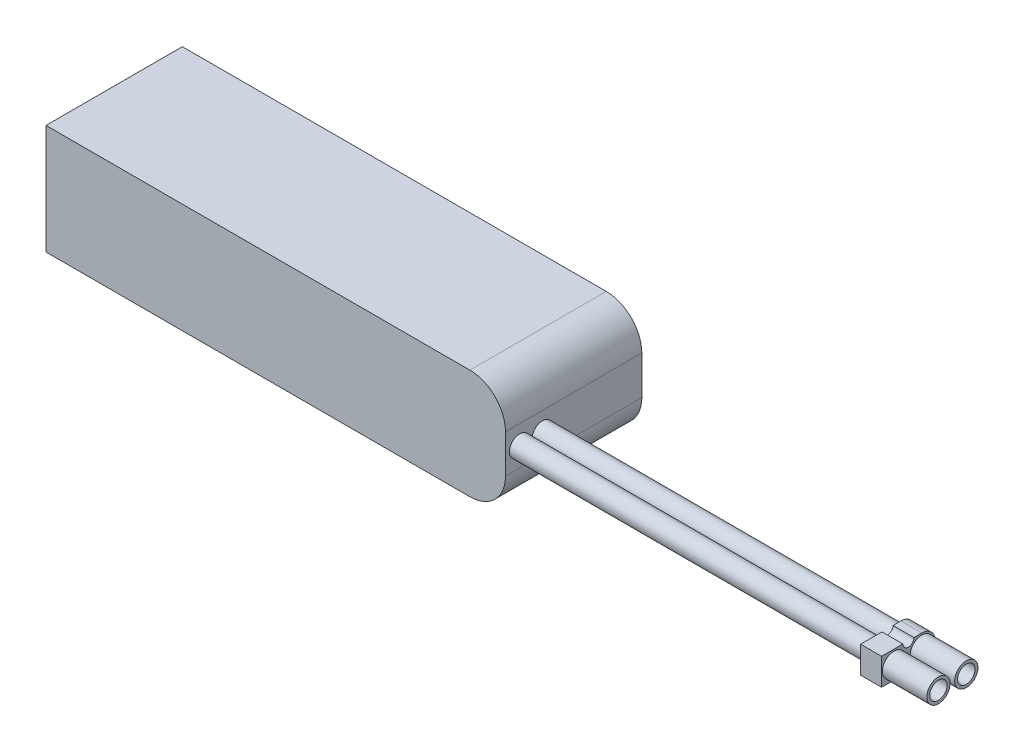
ISO-10303-21;
HEADER;
FILE_DESCRIPTION(('STEP AP214'),'2;1');
FILE_NAME('part.step','',(''),(''),'','','');
FILE_SCHEMA(('AUTOMOTIVE_DESIGN { 1 0 10303 214 1 1 1 1 }'));
ENDSEC;
DATA;
#1=APPLICATION_CONTEXT('core data for automotive mechanical design processes');
#2=APPLICATION_PROTOCOL_DEFINITION('international standard','automotive_design',2000,#1);
#3=PRODUCT_CONTEXT('',#1,'mechanical');
#4=PRODUCT('Part','Part','',(#3));
#5=PRODUCT_RELATED_PRODUCT_CATEGORY('part','',(#4));
#6=PRODUCT_DEFINITION_FORMATION('','',#4);
#7=PRODUCT_DEFINITION_CONTEXT('part definition',#1,'design');
#8=PRODUCT_DEFINITION('design','',#6,#7);
#9=PRODUCT_DEFINITION_SHAPE('','',#8);
#10=(LENGTH_UNIT() NAMED_UNIT(*) SI_UNIT(.MILLI.,.METRE.));
#11=(NAMED_UNIT(*) PLANE_ANGLE_UNIT() SI_UNIT($,.RADIAN.));
#12=(NAMED_UNIT(*) SI_UNIT($,.STERADIAN.) SOLID_ANGLE_UNIT());
#13=UNCERTAINTY_MEASURE_WITH_UNIT(LENGTH_MEASURE(1.E-05),#10,'distance_accuracy_value','');
#14=(GEOMETRIC_REPRESENTATION_CONTEXT(3) GLOBAL_UNCERTAINTY_ASSIGNED_CONTEXT((#13)) GLOBAL_UNIT_ASSIGNED_CONTEXT((#10,
#11,#12)) REPRESENTATION_CONTEXT('',''));
#15=CARTESIAN_POINT('',(0.,0.,0.));
#16=DIRECTION('',(0.,0.,1.));
#17=DIRECTION('',(1.,0.,0.));
#18=AXIS2_PLACEMENT_3D('',#15,#16,#17);
#19=CARTESIAN_POINT('',(-77.5,-18.5,23.));
#20=DIRECTION('',(1.,0.,0.));
#21=DIRECTION('',(0.,0.,-1.));
#22=AXIS2_PLACEMENT_3D('',#19,#20,#21);
#23=PLANE('',#22);
#24=DIRECTION('',(0.,-1.,0.));
#25=VECTOR('',#24,1.);
#26=CARTESIAN_POINT('',(-77.5,-18.5,-23.));
#27=LINE('',#26,#25);
#28=CARTESIAN_POINT('',(-77.5,18.5,-23.));
#29=VERTEX_POINT('',#28);
#30=CARTESIAN_POINT('',(-77.5,-18.5,-23.));
#31=VERTEX_POINT('',#30);
#32=EDGE_CURVE('E163',#29,#31,#27,.T.);
#33=ORIENTED_EDGE('',*,*,#32,.T.);
#34=DIRECTION('',(0.,0.,-1.));
#35=VECTOR('',#34,1.);
#36=CARTESIAN_POINT('',(-77.5,-18.5,23.));
#37=LINE('',#36,#35);
#38=CARTESIAN_POINT('',(-77.5,-18.5,23.));
#39=VERTEX_POINT('',#38);
#40=EDGE_CURVE('E199',#39,#31,#37,.T.);
#41=ORIENTED_EDGE('',*,*,#40,.F.);
#42=DIRECTION('',(0.,-1.,0.));
#43=VECTOR('',#42,1.);
#44=CARTESIAN_POINT('',(-77.5,-18.5,23.));
#45=LINE('',#44,#43);
#46=CARTESIAN_POINT('',(-77.5,18.5,23.));
#47=VERTEX_POINT('',#46);
#48=EDGE_CURVE('E169',#47,#39,#45,.T.);
#49=ORIENTED_EDGE('',*,*,#48,.F.);
#50=DIRECTION('',(0.,0.,-1.));
#51=VECTOR('',#50,1.);
#52=CARTESIAN_POINT('',(-77.5,18.5,23.));
#53=LINE('',#52,#51);
#54=EDGE_CURVE('E183',#47,#29,#53,.T.);
#55=ORIENTED_EDGE('',*,*,#54,.T.);
#56=EDGE_LOOP('',(#33,#41,#49,#55));
#57=FACE_BOUND('',#56,.T.);
#58=ADVANCED_FACE('F39',(#57),#23,.F.);
#59=CARTESIAN_POINT('',(77.5,-18.5,23.));
#60=DIRECTION('',(0.,1.,0.));
#61=DIRECTION('',(-1.,0.,0.));
#62=AXIS2_PLACEMENT_3D('',#59,#60,#61);
#63=PLANE('',#62);
#64=DIRECTION('',(1.,0.,0.));
#65=VECTOR('',#64,1.);
#66=CARTESIAN_POINT('',(77.5,-18.5,-23.));
#67=LINE('',#66,#65);
#68=CARTESIAN_POINT('',(65.5,-18.5,-23.));
#69=VERTEX_POINT('',#68);
#70=EDGE_CURVE('E187',#31,#69,#67,.T.);
#71=ORIENTED_EDGE('',*,*,#70,.T.);
#72=DIRECTION('',(0.,0.,-1.));
#73=VECTOR('',#72,1.);
#74=CARTESIAN_POINT('',(65.5,-18.5,23.));
#75=LINE('',#74,#73);
#76=CARTESIAN_POINT('',(65.5,-18.5,23.));
#77=VERTEX_POINT('',#76);
#78=EDGE_CURVE('E63',#69,#77,#75,.F.);
#79=ORIENTED_EDGE('',*,*,#78,.T.);
#80=DIRECTION('',(1.,0.,0.));
#81=VECTOR('',#80,1.);
#82=CARTESIAN_POINT('',(77.5,-18.5,23.));
#83=LINE('',#82,#81);
#84=EDGE_CURVE('E173',#39,#77,#83,.T.);
#85=ORIENTED_EDGE('',*,*,#84,.F.);
#86=ORIENTED_EDGE('',*,*,#40,.T.);
#87=EDGE_LOOP('',(#71,#79,#85,#86));
#88=FACE_BOUND('',#87,.T.);
#89=ADVANCED_FACE('F319',(#88),#63,.F.);
#90=CARTESIAN_POINT('',(77.5,-18.5,23.));
#91=DIRECTION('',(-1.,0.,0.));
#92=DIRECTION('',(0.,0.,1.));
#93=AXIS2_PLACEMENT_3D('',#90,#91,#92);
#94=PLANE('',#93);
#95=CARTESIAN_POINT('',(77.5,0.,10.5298555470341));
#96=DIRECTION('',(-1.,0.,0.));
#97=DIRECTION('',(0.,0.,1.));
#98=AXIS2_PLACEMENT_3D('',#95,#96,#97);
#99=CIRCLE('',#98,3.47484062640741);
#100=CARTESIAN_POINT('',(77.5,0.,14.0046961734415));
#101=VERTEX_POINT('',#100);
#102=EDGE_CURVE('E234',#101,#101,#99,.F.);
#103=ORIENTED_EDGE('',*,*,#102,.F.);
#104=EDGE_LOOP('',(#103));
#105=FACE_BOUND('',#104,.T.);
#106=CARTESIAN_POINT('',(77.5,0.,18.2062696905234));
#107=DIRECTION('',(-1.,0.,0.));
#108=DIRECTION('',(0.,0.,1.));
#109=AXIS2_PLACEMENT_3D('',#106,#107,#108);
#110=CIRCLE('',#109,3.4846725245643);
#111=CARTESIAN_POINT('',(77.5,0.,21.6909422150877));
#112=VERTEX_POINT('',#111);
#113=EDGE_CURVE('E227',#112,#112,#110,.F.);
#114=ORIENTED_EDGE('',*,*,#113,.F.);
#115=EDGE_LOOP('',(#114));
#116=FACE_BOUND('',#115,.T.);
#117=DIRECTION('',(0.,1.,0.));
#118=VECTOR('',#117,1.);
#119=CARTESIAN_POINT('',(77.5,-18.5,23.));
#120=LINE('',#119,#118);
#121=CARTESIAN_POINT('',(77.5,-6.49999999999999,23.));
#122=VERTEX_POINT('',#121);
#123=CARTESIAN_POINT('',(77.5,6.50000000000001,23.));
#124=VERTEX_POINT('',#123);
#125=EDGE_CURVE('E177',#122,#124,#120,.T.);
#126=ORIENTED_EDGE('',*,*,#125,.F.);
#127=DIRECTION('',(0.,0.,-1.));
#128=VECTOR('',#127,1.);
#129=CARTESIAN_POINT('',(77.5,-6.49999999999999,23.));
#130=LINE('',#129,#128);
#131=CARTESIAN_POINT('',(77.5,-6.49999999999999,-23.));
#132=VERTEX_POINT('',#131);
#133=EDGE_CURVE('E206',#122,#132,#130,.T.);
#134=ORIENTED_EDGE('',*,*,#133,.T.);
#135=DIRECTION('',(0.,1.,0.));
#136=VECTOR('',#135,1.);
#137=CARTESIAN_POINT('',(77.5,-18.5,-23.));
#138=LINE('',#137,#136);
#139=CARTESIAN_POINT('',(77.5,6.50000000000001,-23.));
#140=VERTEX_POINT('',#139);
#141=EDGE_CURVE('E190',#132,#140,#138,.T.);
#142=ORIENTED_EDGE('',*,*,#141,.T.);
#143=DIRECTION('',(0.,0.,-1.));
#144=VECTOR('',#143,1.);
#145=CARTESIAN_POINT('',(77.5,6.50000000000001,23.));
#146=LINE('',#145,#144);
#147=EDGE_CURVE('E203',#140,#124,#146,.F.);
#148=ORIENTED_EDGE('',*,*,#147,.T.);
#149=EDGE_LOOP('',(#126,#134,#142,#148));
#150=FACE_BOUND('',#149,.T.);
#151=ADVANCED_FACE('F325',(#105,#116,#150),#94,.F.);
#152=CARTESIAN_POINT('',(77.5,18.5,23.));
#153=DIRECTION('',(0.,-1.,0.));
#154=DIRECTION('',(1.,0.,0.));
#155=AXIS2_PLACEMENT_3D('',#152,#153,#154);
#156=PLANE('',#155);
#157=DIRECTION('',(-1.,0.,0.));
#158=VECTOR('',#157,1.);
#159=CARTESIAN_POINT('',(77.5,18.5,23.));
#160=LINE('',#159,#158);
#161=CARTESIAN_POINT('',(65.5,18.5,23.));
#162=VERTEX_POINT('',#161);
#163=EDGE_CURVE('E180',#162,#47,#160,.T.);
#164=ORIENTED_EDGE('',*,*,#163,.F.);
#165=DIRECTION('',(0.,0.,-1.));
#166=VECTOR('',#165,1.);
#167=CARTESIAN_POINT('',(65.5,18.5,23.));
#168=LINE('',#167,#166);
#169=CARTESIAN_POINT('',(65.5,18.5,-23.));
#170=VERTEX_POINT('',#169);
#171=EDGE_CURVE('E223',#162,#170,#168,.T.);
#172=ORIENTED_EDGE('',*,*,#171,.T.);
#173=DIRECTION('',(-1.,0.,0.));
#174=VECTOR('',#173,1.);
#175=CARTESIAN_POINT('',(77.5,18.5,-23.));
#176=LINE('',#175,#174);
#177=EDGE_CURVE('E174',#170,#29,#176,.T.);
#178=ORIENTED_EDGE('',*,*,#177,.T.);
#179=ORIENTED_EDGE('',*,*,#54,.F.);
#180=EDGE_LOOP('',(#164,#172,#178,#179));
#181=FACE_BOUND('',#180,.T.);
#182=ADVANCED_FACE('F350',(#181),#156,.F.);
#183=CARTESIAN_POINT('',(0.,0.,23.));
#184=DIRECTION('',(0.,0.,1.));
#185=DIRECTION('',(1.,0.,0.));
#186=AXIS2_PLACEMENT_3D('',#183,#184,#185);
#187=PLANE('',#186);
#188=ORIENTED_EDGE('',*,*,#84,.T.);
#189=CARTESIAN_POINT('',(65.5,-6.49999999999999,23.));
#190=DIRECTION('',(0.,0.,1.));
#191=DIRECTION('',(1.,0.,0.));
#192=AXIS2_PLACEMENT_3D('',#189,#190,#191);
#193=CIRCLE('',#192,12.);
#194=EDGE_CURVE('E220',#77,#122,#193,.T.);
#195=ORIENTED_EDGE('',*,*,#194,.T.);
#196=ORIENTED_EDGE('',*,*,#125,.T.);
#197=CARTESIAN_POINT('',(65.5,6.50000000000001,23.));
#198=DIRECTION('',(0.,0.,1.));
#199=DIRECTION('',(1.,0.,0.));
#200=AXIS2_PLACEMENT_3D('',#197,#198,#199);
#201=CIRCLE('',#200,12.);
#202=EDGE_CURVE('E55',#124,#162,#201,.T.);
#203=ORIENTED_EDGE('',*,*,#202,.T.);
#204=ORIENTED_EDGE('',*,*,#163,.T.);
#205=ORIENTED_EDGE('',*,*,#48,.T.);
#206=EDGE_LOOP('',(#188,#195,#196,#203,#204,#205));
#207=FACE_BOUND('',#206,.T.);
#208=ADVANCED_FACE('F338',(#207),#187,.T.);
#209=CARTESIAN_POINT('',(0.,0.,-23.));
#210=DIRECTION('',(0.,0.,1.));
#211=DIRECTION('',(1.,0.,0.));
#212=AXIS2_PLACEMENT_3D('',#209,#210,#211);
#213=PLANE('',#212);
#214=ORIENTED_EDGE('',*,*,#141,.F.);
#215=CARTESIAN_POINT('',(65.5,-6.49999999999999,-23.));
#216=DIRECTION('',(0.,0.,1.));
#217=DIRECTION('',(1.,0.,0.));
#218=AXIS2_PLACEMENT_3D('',#215,#216,#217);
#219=CIRCLE('',#218,12.);
#220=EDGE_CURVE('E213',#132,#69,#219,.F.);
#221=ORIENTED_EDGE('',*,*,#220,.T.);
#222=ORIENTED_EDGE('',*,*,#70,.F.);
#223=ORIENTED_EDGE('',*,*,#32,.F.);
#224=ORIENTED_EDGE('',*,*,#177,.F.);
#225=CARTESIAN_POINT('',(65.5,6.50000000000001,-23.));
#226=DIRECTION('',(0.,0.,1.));
#227=DIRECTION('',(1.,0.,0.));
#228=AXIS2_PLACEMENT_3D('',#225,#226,#227);
#229=CIRCLE('',#228,12.);
#230=EDGE_CURVE('E210',#170,#140,#229,.F.);
#231=ORIENTED_EDGE('',*,*,#230,.T.);
#232=EDGE_LOOP('',(#214,#221,#222,#223,#224,#231));
#233=FACE_BOUND('',#232,.T.);
#234=ADVANCED_FACE('F330',(#233),#213,.F.);
#235=CARTESIAN_POINT('',(65.5,-6.49999999999999,23.));
#236=DIRECTION('',(0.,0.,-1.));
#237=DIRECTION('',(-1.,0.,0.));
#238=AXIS2_PLACEMENT_3D('',#235,#236,#237);
#239=CYLINDRICAL_SURFACE('',#238,12.);
#240=ORIENTED_EDGE('',*,*,#194,.F.);
#241=ORIENTED_EDGE('',*,*,#78,.F.);
#242=ORIENTED_EDGE('',*,*,#220,.F.);
#243=ORIENTED_EDGE('',*,*,#133,.F.);
#244=EDGE_LOOP('',(#240,#241,#242,#243));
#245=FACE_BOUND('',#244,.T.);
#246=ADVANCED_FACE('F328',(#245),#239,.T.);
#247=CARTESIAN_POINT('',(65.5,6.50000000000001,23.));
#248=DIRECTION('',(0.,0.,-1.));
#249=DIRECTION('',(-1.,0.,0.));
#250=AXIS2_PLACEMENT_3D('',#247,#248,#249);
#251=CYLINDRICAL_SURFACE('',#250,12.);
#252=ORIENTED_EDGE('',*,*,#202,.F.);
#253=ORIENTED_EDGE('',*,*,#147,.F.);
#254=ORIENTED_EDGE('',*,*,#230,.F.);
#255=ORIENTED_EDGE('',*,*,#171,.F.);
#256=EDGE_LOOP('',(#252,#253,#254,#255));
#257=FACE_BOUND('',#256,.T.);
#258=ADVANCED_FACE('F41',(#257),#251,.T.);
#259=CARTESIAN_POINT('',(197.5,0.,18.2062696905234));
#260=DIRECTION('',(-1.,0.,0.));
#261=DIRECTION('',(0.,0.,1.));
#262=AXIS2_PLACEMENT_3D('',#259,#260,#261);
#263=CYLINDRICAL_SURFACE('',#262,3.4846725245643);
#264=CARTESIAN_POINT('',(197.5,0.,18.2062696905234));
#265=DIRECTION('',(1.,0.,0.));
#266=DIRECTION('',(0.,0.,-1.));
#267=AXIS2_PLACEMENT_3D('',#264,#265,#266);
#268=CIRCLE('',#267,3.4846725245643);
#269=CARTESIAN_POINT('',(197.5,0.,14.7215971659591));
#270=VERTEX_POINT('',#269);
#271=EDGE_CURVE('E158',#270,#270,#268,.T.);
#272=ORIENTED_EDGE('',*,*,#271,.F.);
#273=EDGE_LOOP('',(#272));
#274=FACE_BOUND('',#273,.T.);
#275=ORIENTED_EDGE('',*,*,#113,.T.);
#276=EDGE_LOOP('',(#275));
#277=FACE_BOUND('',#276,.T.);
#278=ADVANCED_FACE('F336',(#274,#277),#263,.T.);
#279=CARTESIAN_POINT('',(204.57,-4.53,0.));
#280=DIRECTION('',(0.,1.,0.));
#281=DIRECTION('',(0.,0.,1.));
#282=AXIS2_PLACEMENT_3D('',#279,#280,#281);
#283=PLANE('',#282);
#284=DIRECTION('',(0.,0.,-1.));
#285=VECTOR('',#284,1.);
#286=CARTESIAN_POINT('',(197.5,-4.53,0.));
#287=LINE('',#286,#285);
#288=CARTESIAN_POINT('',(197.5,-4.53,23.185125141606));
#289=VERTEX_POINT('',#288);
#290=CARTESIAN_POINT('',(197.5,-4.53,9.59512514160601));
#291=VERTEX_POINT('',#290);
#292=EDGE_CURVE('E156',#289,#291,#287,.T.);
#293=ORIENTED_EDGE('',*,*,#292,.T.);
#294=DIRECTION('',(-1.,0.,0.));
#295=VECTOR('',#294,1.);
#296=CARTESIAN_POINT('',(204.57,-4.53,9.59512514160601));
#297=LINE('',#296,#295);
#298=CARTESIAN_POINT('',(204.57,-4.53,9.59512514160601));
#299=VERTEX_POINT('',#298);
#300=EDGE_CURVE('E135',#299,#291,#297,.T.);
#301=ORIENTED_EDGE('',*,*,#300,.F.);
#302=DIRECTION('',(0.,0.,-1.));
#303=VECTOR('',#302,1.);
#304=CARTESIAN_POINT('',(204.57,-4.53,0.));
#305=LINE('',#304,#303);
#306=CARTESIAN_POINT('',(204.57,-4.53,23.185125141606));
#307=VERTEX_POINT('',#306);
#308=EDGE_CURVE('E143',#307,#299,#305,.T.);
#309=ORIENTED_EDGE('',*,*,#308,.F.);
#310=DIRECTION('',(-1.,0.,0.));
#311=VECTOR('',#310,1.);
#312=CARTESIAN_POINT('',(204.57,-4.53,23.185125141606));
#313=LINE('',#312,#311);
#314=EDGE_CURVE('E259',#307,#289,#313,.T.);
#315=ORIENTED_EDGE('',*,*,#314,.T.);
#316=EDGE_LOOP('',(#293,#301,#309,#315));
#317=FACE_BOUND('',#316,.T.);
#318=ADVANCED_FACE('F154',(#317),#283,.F.);
#319=CARTESIAN_POINT('',(204.57,0.,9.59512514160601));
#320=DIRECTION('',(-1.,0.,0.));
#321=DIRECTION('',(0.,0.,1.));
#322=AXIS2_PLACEMENT_3D('',#319,#320,#321);
#323=CYLINDRICAL_SURFACE('',#322,4.53);
#324=CARTESIAN_POINT('',(197.5,0.,9.59512514160601));
#325=DIRECTION('',(1.,0.,0.));
#326=DIRECTION('',(0.,0.,-1.));
#327=AXIS2_PLACEMENT_3D('',#324,#325,#326);
#328=CIRCLE('',#327,4.53);
#329=CARTESIAN_POINT('',(197.5,4.53,9.59512514160602));
#330=VERTEX_POINT('',#329);
#331=EDGE_CURVE('E262',#291,#330,#328,.T.);
#332=ORIENTED_EDGE('',*,*,#331,.T.);
#333=DIRECTION('',(-1.,0.,0.));
#334=VECTOR('',#333,1.);
#335=CARTESIAN_POINT('',(204.57,4.53,9.59512514160602));
#336=LINE('',#335,#334);
#337=CARTESIAN_POINT('',(204.57,4.53,9.59512514160602));
#338=VERTEX_POINT('',#337);
#339=EDGE_CURVE('E138',#338,#330,#336,.T.);
#340=ORIENTED_EDGE('',*,*,#339,.F.);
#341=CARTESIAN_POINT('',(204.57,0.,9.59512514160601));
#342=DIRECTION('',(1.,0.,0.));
#343=DIRECTION('',(0.,0.,-1.));
#344=AXIS2_PLACEMENT_3D('',#341,#342,#343);
#345=CIRCLE('',#344,4.53);
#346=EDGE_CURVE('E131',#299,#338,#345,.T.);
#347=ORIENTED_EDGE('',*,*,#346,.F.);
#348=ORIENTED_EDGE('',*,*,#300,.T.);
#349=EDGE_LOOP('',(#332,#340,#347,#348));
#350=FACE_BOUND('',#349,.T.);
#351=ADVANCED_FACE('F133',(#350),#323,.T.);
#352=CARTESIAN_POINT('',(204.57,4.53,0.));
#353=DIRECTION('',(0.,-1.,0.));
#354=DIRECTION('',(0.,0.,-1.));
#355=AXIS2_PLACEMENT_3D('',#352,#353,#354);
#356=PLANE('',#355);
#357=DIRECTION('',(0.,0.,1.));
#358=VECTOR('',#357,1.);
#359=CARTESIAN_POINT('',(197.5,4.53,0.));
#360=LINE('',#359,#358);
#361=CARTESIAN_POINT('',(197.5,4.53,12.2487377040559));
#362=VERTEX_POINT('',#361);
#363=EDGE_CURVE('E265',#330,#362,#360,.T.);
#364=ORIENTED_EDGE('',*,*,#363,.T.);
#365=DIRECTION('',(-1.,0.,0.));
#366=VECTOR('',#365,1.);
#367=CARTESIAN_POINT('',(204.57,4.53,12.2487377040559));
#368=LINE('',#367,#366);
#369=CARTESIAN_POINT('',(204.57,4.53,12.2487377040559));
#370=VERTEX_POINT('',#369);
#371=EDGE_CURVE('E165',#370,#362,#368,.T.);
#372=ORIENTED_EDGE('',*,*,#371,.F.);
#373=DIRECTION('',(0.,0.,1.));
#374=VECTOR('',#373,1.);
#375=CARTESIAN_POINT('',(204.57,4.53,0.));
#376=LINE('',#375,#374);
#377=EDGE_CURVE('E142',#338,#370,#376,.T.);
#378=ORIENTED_EDGE('',*,*,#377,.F.);
#379=ORIENTED_EDGE('',*,*,#339,.T.);
#380=EDGE_LOOP('',(#364,#372,#378,#379));
#381=FACE_BOUND('',#380,.T.);
#382=ADVANCED_FACE('F295',(#381),#356,.F.);
#383=CARTESIAN_POINT('',(204.57,4.53,14.125125141606));
#384=DIRECTION('',(-1.,0.,0.));
#385=DIRECTION('',(0.,0.,1.));
#386=AXIS2_PLACEMENT_3D('',#383,#384,#385);
#387=CYLINDRICAL_SURFACE('',#386,1.87638743755012);
#388=CARTESIAN_POINT('',(197.5,4.53,14.125125141606));
#389=DIRECTION('',(1.,0.,0.));
#390=DIRECTION('',(0.,0.,-1.));
#391=AXIS2_PLACEMENT_3D('',#388,#389,#390);
#392=CIRCLE('',#391,1.87638743755012);
#393=CARTESIAN_POINT('',(197.5,4.53,16.0015125791561));
#394=VERTEX_POINT('',#393);
#395=EDGE_CURVE('E269',#394,#362,#392,.T.);
#396=ORIENTED_EDGE('',*,*,#395,.F.);
#397=DIRECTION('',(-1.,0.,0.));
#398=VECTOR('',#397,1.);
#399=CARTESIAN_POINT('',(204.57,4.53,16.0015125791561));
#400=LINE('',#399,#398);
#401=CARTESIAN_POINT('',(204.57,4.53,16.0015125791561));
#402=VERTEX_POINT('',#401);
#403=EDGE_CURVE('E285',#402,#394,#400,.T.);
#404=ORIENTED_EDGE('',*,*,#403,.F.);
#405=CARTESIAN_POINT('',(204.57,4.53,14.125125141606));
#406=DIRECTION('',(1.,0.,0.));
#407=DIRECTION('',(0.,0.,-1.));
#408=AXIS2_PLACEMENT_3D('',#405,#406,#407);
#409=CIRCLE('',#408,1.87638743755012);
#410=EDGE_CURVE('E250',#402,#370,#409,.T.);
#411=ORIENTED_EDGE('',*,*,#410,.T.);
#412=ORIENTED_EDGE('',*,*,#371,.T.);
#413=EDGE_LOOP('',(#396,#404,#411,#412));
#414=FACE_BOUND('',#413,.T.);
#415=ADVANCED_FACE('F291',(#414),#387,.F.);
#416=CARTESIAN_POINT('',(204.57,4.53,0.));
#417=DIRECTION('',(0.,-1.,0.));
#418=DIRECTION('',(0.,0.,-1.));
#419=AXIS2_PLACEMENT_3D('',#416,#417,#418);
#420=PLANE('',#419);
#421=DIRECTION('',(0.,0.,1.));
#422=VECTOR('',#421,1.);
#423=CARTESIAN_POINT('',(197.5,4.53,0.));
#424=LINE('',#423,#422);
#425=CARTESIAN_POINT('',(197.5,4.53,23.185125141606));
#426=VERTEX_POINT('',#425);
#427=EDGE_CURVE('E273',#394,#426,#424,.T.);
#428=ORIENTED_EDGE('',*,*,#427,.T.);
#429=DIRECTION('',(-1.,0.,0.));
#430=VECTOR('',#429,1.);
#431=CARTESIAN_POINT('',(204.57,4.53,23.185125141606));
#432=LINE('',#431,#430);
#433=CARTESIAN_POINT('',(204.57,4.53,23.185125141606));
#434=VERTEX_POINT('',#433);
#435=EDGE_CURVE('E282',#434,#426,#432,.T.);
#436=ORIENTED_EDGE('',*,*,#435,.F.);
#437=DIRECTION('',(0.,0.,1.));
#438=VECTOR('',#437,1.);
#439=CARTESIAN_POINT('',(204.57,4.53,0.));
#440=LINE('',#439,#438);
#441=EDGE_CURVE('E254',#402,#434,#440,.T.);
#442=ORIENTED_EDGE('',*,*,#441,.F.);
#443=ORIENTED_EDGE('',*,*,#403,.T.);
#444=EDGE_LOOP('',(#428,#436,#442,#443));
#445=FACE_BOUND('',#444,.T.);
#446=ADVANCED_FACE('F302',(#445),#420,.F.);
#447=CARTESIAN_POINT('',(204.57,0.,23.185125141606));
#448=DIRECTION('',(0.,0.,1.));
#449=DIRECTION('',(1.,0.,0.));
#450=AXIS2_PLACEMENT_3D('',#447,#448,#449);
#451=PLANE('',#450);
#452=DIRECTION('',(0.,1.,0.));
#453=VECTOR('',#452,1.);
#454=CARTESIAN_POINT('',(197.5,0.,23.185125141606));
#455=LINE('',#454,#453);
#456=EDGE_CURVE('E152',#289,#426,#455,.T.);
#457=ORIENTED_EDGE('',*,*,#456,.F.);
#458=ORIENTED_EDGE('',*,*,#314,.F.);
#459=DIRECTION('',(0.,1.,0.));
#460=VECTOR('',#459,1.);
#461=CARTESIAN_POINT('',(204.57,0.,23.185125141606));
#462=LINE('',#461,#460);
#463=EDGE_CURVE('E149',#307,#434,#462,.T.);
#464=ORIENTED_EDGE('',*,*,#463,.T.);
#465=ORIENTED_EDGE('',*,*,#435,.T.);
#466=EDGE_LOOP('',(#457,#458,#464,#465));
#467=FACE_BOUND('',#466,.T.);
#468=ADVANCED_FACE('F305',(#467),#451,.T.);
#469=CARTESIAN_POINT('',(204.57,0.,0.));
#470=DIRECTION('',(1.,0.,0.));
#471=DIRECTION('',(0.,0.,-1.));
#472=AXIS2_PLACEMENT_3D('',#469,#470,#471);
#473=PLANE('',#472);
#474=CARTESIAN_POINT('',(204.57,0.,9.59512514160601));
#475=DIRECTION('',(1.,0.,0.));
#476=DIRECTION('',(0.,0.,-1.));
#477=AXIS2_PLACEMENT_3D('',#474,#475,#476);
#478=CIRCLE('',#477,3.935);
#479=CARTESIAN_POINT('',(204.57,0.,5.66012514160601));
#480=VERTEX_POINT('',#479);
#481=EDGE_CURVE('E522',#480,#480,#478,.T.);
#482=ORIENTED_EDGE('',*,*,#481,.F.);
#483=EDGE_LOOP('',(#482));
#484=FACE_BOUND('',#483,.T.);
#485=CARTESIAN_POINT('',(204.57,0.,19.));
#486=DIRECTION('',(1.,0.,0.));
#487=DIRECTION('',(0.,0.,-1.));
#488=AXIS2_PLACEMENT_3D('',#485,#486,#487);
#489=CIRCLE('',#488,3.935);
#490=CARTESIAN_POINT('',(204.57,0.,15.065));
#491=VERTEX_POINT('',#490);
#492=EDGE_CURVE('E48',#491,#491,#489,.T.);
#493=ORIENTED_EDGE('',*,*,#492,.F.);
#494=EDGE_LOOP('',(#493));
#495=FACE_BOUND('',#494,.T.);
#496=ORIENTED_EDGE('',*,*,#308,.T.);
#497=ORIENTED_EDGE('',*,*,#346,.T.);
#498=ORIENTED_EDGE('',*,*,#377,.T.);
#499=ORIENTED_EDGE('',*,*,#410,.F.);
#500=ORIENTED_EDGE('',*,*,#441,.T.);
#501=ORIENTED_EDGE('',*,*,#463,.F.);
#502=EDGE_LOOP('',(#496,#497,#498,#499,#500,#501));
#503=FACE_BOUND('',#502,.T.);
#504=ADVANCED_FACE('F147',(#484,#495,#503),#473,.T.);
#505=CARTESIAN_POINT('',(197.5,0.,0.));
#506=DIRECTION('',(1.,0.,0.));
#507=DIRECTION('',(0.,0.,-1.));
#508=AXIS2_PLACEMENT_3D('',#505,#506,#507);
#509=PLANE('',#508);
#510=CARTESIAN_POINT('',(197.5,0.,10.5298555470341));
#511=DIRECTION('',(1.,0.,0.));
#512=DIRECTION('',(0.,0.,-1.));
#513=AXIS2_PLACEMENT_3D('',#510,#511,#512);
#514=CIRCLE('',#513,3.47484062640741);
#515=CARTESIAN_POINT('',(197.5,0.,7.05501492062671));
#516=VERTEX_POINT('',#515);
#517=EDGE_CURVE('E231',#516,#516,#514,.F.);
#518=ORIENTED_EDGE('',*,*,#517,.F.);
#519=EDGE_LOOP('',(#518));
#520=FACE_BOUND('',#519,.T.);
#521=ORIENTED_EDGE('',*,*,#271,.T.);
#522=EDGE_LOOP('',(#521));
#523=FACE_BOUND('',#522,.T.);
#524=ORIENTED_EDGE('',*,*,#292,.F.);
#525=ORIENTED_EDGE('',*,*,#456,.T.);
#526=ORIENTED_EDGE('',*,*,#427,.F.);
#527=ORIENTED_EDGE('',*,*,#395,.T.);
#528=ORIENTED_EDGE('',*,*,#363,.F.);
#529=ORIENTED_EDGE('',*,*,#331,.F.);
#530=EDGE_LOOP('',(#524,#525,#526,#527,#528,#529));
#531=FACE_BOUND('',#530,.T.);
#532=ADVANCED_FACE('F298',(#520,#523,#531),#509,.F.);
#533=CARTESIAN_POINT('',(200.5,0.,10.5298555470341));
#534=DIRECTION('',(-1.,0.,0.));
#535=DIRECTION('',(0.,0.,1.));
#536=AXIS2_PLACEMENT_3D('',#533,#534,#535);
#537=CYLINDRICAL_SURFACE('',#536,3.47484062640741);
#538=ORIENTED_EDGE('',*,*,#102,.T.);
#539=EDGE_LOOP('',(#538));
#540=FACE_BOUND('',#539,.T.);
#541=ORIENTED_EDGE('',*,*,#517,.T.);
#542=EDGE_LOOP('',(#541));
#543=FACE_BOUND('',#542,.T.);
#544=ADVANCED_FACE('F404',(#540,#543),#537,.T.);
#545=CARTESIAN_POINT('',(219.57,0.,19.));
#546=DIRECTION('',(1.,0.,0.));
#547=DIRECTION('',(0.,0.,-1.));
#548=AXIS2_PLACEMENT_3D('',#545,#546,#547);
#549=PLANE('',#548);
#550=CARTESIAN_POINT('',(219.57,0.,19.));
#551=DIRECTION('',(1.,0.,0.));
#552=DIRECTION('',(0.,0.,-1.));
#553=AXIS2_PLACEMENT_3D('',#550,#551,#552);
#554=CIRCLE('',#553,3.935);
#555=CARTESIAN_POINT('',(219.57,0.,15.065));
#556=VERTEX_POINT('',#555);
#557=EDGE_CURVE('E245',#556,#556,#554,.T.);
#558=ORIENTED_EDGE('',*,*,#557,.T.);
#559=EDGE_LOOP('',(#558));
#560=FACE_BOUND('',#559,.T.);
#561=CARTESIAN_POINT('',(219.57,0.,19.));
#562=DIRECTION('',(1.,0.,0.));
#563=DIRECTION('',(0.,0.,-1.));
#564=AXIS2_PLACEMENT_3D('',#561,#562,#563);
#565=CIRCLE('',#564,2.935);
#566=CARTESIAN_POINT('',(219.57,0.,16.065));
#567=VERTEX_POINT('',#566);
#568=EDGE_CURVE('E533',#567,#567,#565,.T.);
#569=ORIENTED_EDGE('',*,*,#568,.F.);
#570=EDGE_LOOP('',(#569));
#571=FACE_BOUND('',#570,.T.);
#572=ADVANCED_FACE('F414',(#560,#571),#549,.T.);
#573=CARTESIAN_POINT('',(219.57,0.,19.));
#574=DIRECTION('',(-1.,0.,0.));
#575=DIRECTION('',(0.,0.,1.));
#576=AXIS2_PLACEMENT_3D('',#573,#574,#575);
#577=CYLINDRICAL_SURFACE('',#576,3.935);
#578=ORIENTED_EDGE('',*,*,#557,.F.);
#579=EDGE_LOOP('',(#578));
#580=FACE_BOUND('',#579,.T.);
#581=ORIENTED_EDGE('',*,*,#492,.T.);
#582=EDGE_LOOP('',(#581));
#583=FACE_BOUND('',#582,.T.);
#584=ADVANCED_FACE('F432',(#580,#583),#577,.T.);
#585=CARTESIAN_POINT('',(219.57,0.,19.));
#586=DIRECTION('',(-1.,0.,0.));
#587=DIRECTION('',(0.,0.,1.));
#588=AXIS2_PLACEMENT_3D('',#585,#586,#587);
#589=CYLINDRICAL_SURFACE('',#588,2.935);
#590=ORIENTED_EDGE('',*,*,#568,.T.);
#591=EDGE_LOOP('',(#590));
#592=FACE_BOUND('',#591,.T.);
#593=CARTESIAN_POINT('',(204.57,0.,19.));
#594=DIRECTION('',(1.,0.,0.));
#595=DIRECTION('',(0.,0.,-1.));
#596=AXIS2_PLACEMENT_3D('',#593,#594,#595);
#597=CIRCLE('',#596,2.935);
#598=CARTESIAN_POINT('',(204.57,0.,16.065));
#599=VERTEX_POINT('',#598);
#600=EDGE_CURVE('E531',#599,#599,#597,.T.);
#601=ORIENTED_EDGE('',*,*,#600,.F.);
#602=EDGE_LOOP('',(#601));
#603=FACE_BOUND('',#602,.T.);
#604=ADVANCED_FACE('F443',(#592,#603),#589,.F.);
#605=ORIENTED_EDGE('',*,*,#600,.T.);
#606=EDGE_LOOP('',(#605));
#607=FACE_BOUND('',#606,.T.);
#608=ADVANCED_FACE('F315',(#607),#473,.T.);
#609=CARTESIAN_POINT('',(219.57,0.,9.59512514160601));
#610=DIRECTION('',(1.,0.,0.));
#611=DIRECTION('',(0.,0.,-1.));
#612=AXIS2_PLACEMENT_3D('',#609,#610,#611);
#613=PLANE('',#612);
#614=CARTESIAN_POINT('',(219.57,0.,9.59512514160601));
#615=DIRECTION('',(1.,0.,0.));
#616=DIRECTION('',(0.,0.,-1.));
#617=AXIS2_PLACEMENT_3D('',#614,#615,#616);
#618=CIRCLE('',#617,3.935);
#619=CARTESIAN_POINT('',(219.57,0.,5.66012514160601));
#620=VERTEX_POINT('',#619);
#621=EDGE_CURVE('E526',#620,#620,#618,.T.);
#622=ORIENTED_EDGE('',*,*,#621,.T.);
#623=EDGE_LOOP('',(#622));
#624=FACE_BOUND('',#623,.T.);
#625=CARTESIAN_POINT('',(219.57,0.,9.59512514160601));
#626=DIRECTION('',(1.,0.,0.));
#627=DIRECTION('',(0.,0.,-1.));
#628=AXIS2_PLACEMENT_3D('',#625,#626,#627);
#629=CIRCLE('',#628,2.935);
#630=CARTESIAN_POINT('',(219.57,0.,6.66012514160601));
#631=VERTEX_POINT('',#630);
#632=EDGE_CURVE('E519',#631,#631,#629,.T.);
#633=ORIENTED_EDGE('',*,*,#632,.F.);
#634=EDGE_LOOP('',(#633));
#635=FACE_BOUND('',#634,.T.);
#636=ADVANCED_FACE('F463',(#624,#635),#613,.T.);
#637=CARTESIAN_POINT('',(219.57,0.,9.59512514160601));
#638=DIRECTION('',(-1.,0.,0.));
#639=DIRECTION('',(0.,0.,1.));
#640=AXIS2_PLACEMENT_3D('',#637,#638,#639);
#641=CYLINDRICAL_SURFACE('',#640,3.935);
#642=ORIENTED_EDGE('',*,*,#621,.F.);
#643=EDGE_LOOP('',(#642));
#644=FACE_BOUND('',#643,.T.);
#645=ORIENTED_EDGE('',*,*,#481,.T.);
#646=EDGE_LOOP('',(#645));
#647=FACE_BOUND('',#646,.T.);
#648=ADVANCED_FACE('F473',(#644,#647),#641,.T.);
#649=CARTESIAN_POINT('',(219.57,0.,9.59512514160601));
#650=DIRECTION('',(-1.,0.,0.));
#651=DIRECTION('',(0.,0.,1.));
#652=AXIS2_PLACEMENT_3D('',#649,#650,#651);
#653=CYLINDRICAL_SURFACE('',#652,2.935);
#654=ORIENTED_EDGE('',*,*,#632,.T.);
#655=EDGE_LOOP('',(#654));
#656=FACE_BOUND('',#655,.T.);
#657=CARTESIAN_POINT('',(204.57,0.,9.59512514160601));
#658=DIRECTION('',(1.,0.,0.));
#659=DIRECTION('',(0.,0.,-1.));
#660=AXIS2_PLACEMENT_3D('',#657,#658,#659);
#661=CIRCLE('',#660,2.935);
#662=CARTESIAN_POINT('',(204.57,0.,6.66012514160601));
#663=VERTEX_POINT('',#662);
#664=EDGE_CURVE('E11',#663,#663,#661,.F.);
#665=ORIENTED_EDGE('',*,*,#664,.T.);
#666=EDGE_LOOP('',(#665));
#667=FACE_BOUND('',#666,.T.);
#668=ADVANCED_FACE('F483',(#656,#667),#653,.F.);
#669=ORIENTED_EDGE('',*,*,#664,.F.);
#670=EDGE_LOOP('',(#669));
#671=FACE_BOUND('',#670,.T.);
#672=ADVANCED_FACE('F314',(#671),#473,.T.);
#673=CLOSED_SHELL('',(#58,#89,#151,#182,#208,#234,#246,#258,#278,#318,#351,#382,#415,#446,#468,
#504,#532,#544,#572,#584,#604,#608,#636,#648,#668,#672));
#674=MANIFOLD_SOLID_BREP('B2',#673);
#675=ADVANCED_BREP_SHAPE_REPRESENTATION('',(#18,#674),#14);
#676=SHAPE_DEFINITION_REPRESENTATION(#9,#675);
ENDSEC;
END-ISO-10303-21;
